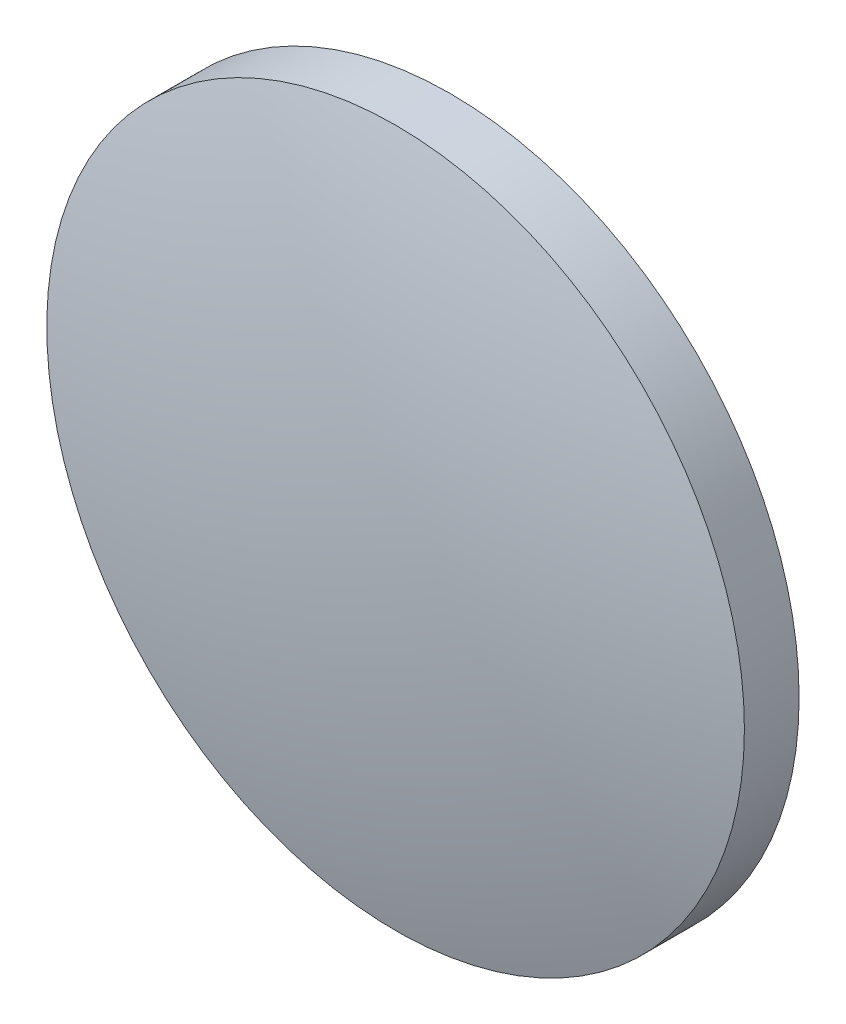
ISO-10303-21;
HEADER;
FILE_DESCRIPTION(('STEP AP214'),'2;1');
FILE_NAME('part.step','',(''),(''),'','','');
FILE_SCHEMA(('AUTOMOTIVE_DESIGN { 1 0 10303 214 1 1 1 1 }'));
ENDSEC;
DATA;
#1=APPLICATION_CONTEXT('core data for automotive mechanical design processes');
#2=APPLICATION_PROTOCOL_DEFINITION('international standard','automotive_design',2000,#1);
#3=PRODUCT_CONTEXT('',#1,'mechanical');
#4=PRODUCT('Part','Part','',(#3));
#5=PRODUCT_RELATED_PRODUCT_CATEGORY('part','',(#4));
#6=PRODUCT_DEFINITION_FORMATION('','',#4);
#7=PRODUCT_DEFINITION_CONTEXT('part definition',#1,'design');
#8=PRODUCT_DEFINITION('design','',#6,#7);
#9=PRODUCT_DEFINITION_SHAPE('','',#8);
#10=(LENGTH_UNIT() NAMED_UNIT(*) SI_UNIT(.MILLI.,.METRE.));
#11=(NAMED_UNIT(*) PLANE_ANGLE_UNIT() SI_UNIT($,.RADIAN.));
#12=(NAMED_UNIT(*) SI_UNIT($,.STERADIAN.) SOLID_ANGLE_UNIT());
#13=UNCERTAINTY_MEASURE_WITH_UNIT(LENGTH_MEASURE(1.E-05),#10,'distance_accuracy_value','');
#14=(GEOMETRIC_REPRESENTATION_CONTEXT(3) GLOBAL_UNCERTAINTY_ASSIGNED_CONTEXT((#13)) GLOBAL_UNIT_ASSIGNED_CONTEXT((#10,
#11,#12)) REPRESENTATION_CONTEXT('',''));
#15=CARTESIAN_POINT('',(0.,0.,0.));
#16=DIRECTION('',(0.,0.,1.));
#17=DIRECTION('',(1.,0.,0.));
#18=AXIS2_PLACEMENT_3D('',#15,#16,#17);
#19=CARTESIAN_POINT('',(0.,0.,-47.2277874769358));
#20=DIRECTION('',(0.,0.,1.));
#21=DIRECTION('',(0.,1.,0.));
#22=AXIS2_PLACEMENT_3D('',#19,#20,#21);
#23=SPHERICAL_SURFACE('',#22,49.06);
#24=CARTESIAN_POINT('',(0.,0.,0.15990712830956));
#25=DIRECTION('',(0.,0.,1.));
#26=DIRECTION('',(1.,0.,0.));
#27=AXIS2_PLACEMENT_3D('',#24,#25,#26);
#28=CIRCLE('',#27,12.7);
#29=CARTESIAN_POINT('',(12.7,0.,0.15990712830956));
#30=VERTEX_POINT('',#29);
#31=EDGE_CURVE('E8',#30,#30,#28,.T.);
#32=ORIENTED_EDGE('',*,*,#31,.T.);
#33=EDGE_LOOP('',(#32));
#34=FACE_BOUND('',#33,.T.);
#35=ADVANCED_FACE('F12',(#34),#23,.T.);
#36=CARTESIAN_POINT('',(0.,0.,9.21231627790526));
#37=DIRECTION('',(0.,0.,1.));
#38=DIRECTION('',(1.,0.,0.));
#39=AXIS2_PLACEMENT_3D('',#36,#37,#38);
#40=CYLINDRICAL_SURFACE('',#39,12.7);
#41=ORIENTED_EDGE('',*,*,#31,.F.);
#42=EDGE_LOOP('',(#41));
#43=FACE_BOUND('',#42,.T.);
#44=CARTESIAN_POINT('',(0.,0.,-1.8322125230642));
#45=DIRECTION('',(0.,0.,1.));
#46=DIRECTION('',(1.,0.,0.));
#47=AXIS2_PLACEMENT_3D('',#44,#45,#46);
#48=CIRCLE('',#47,12.7);
#49=CARTESIAN_POINT('',(12.7,0.,-1.8322125230642));
#50=VERTEX_POINT('',#49);
#51=EDGE_CURVE('E18',#50,#50,#48,.T.);
#52=ORIENTED_EDGE('',*,*,#51,.T.);
#53=EDGE_LOOP('',(#52));
#54=FACE_BOUND('',#53,.T.);
#55=ADVANCED_FACE('F24',(#43,#54),#40,.T.);
#56=CARTESIAN_POINT('',(0.,0.,-132.777787476936));
#57=DIRECTION('',(0.,0.,1.));
#58=DIRECTION('',(0.,1.,0.));
#59=AXIS2_PLACEMENT_3D('',#56,#57,#58);
#60=SPHERICAL_SURFACE('',#59,131.56);
#61=ORIENTED_EDGE('',*,*,#51,.F.);
#62=EDGE_LOOP('',(#61));
#63=FACE_BOUND('',#62,.T.);
#64=ADVANCED_FACE('F26',(#63),#60,.F.);
#65=CLOSED_SHELL('',(#35,#55,#64));
#66=MANIFOLD_SOLID_BREP('B1',#65);
#67=ADVANCED_BREP_SHAPE_REPRESENTATION('',(#18,#66),#14);
#68=SHAPE_DEFINITION_REPRESENTATION(#9,#67);
ENDSEC;
END-ISO-10303-21;
